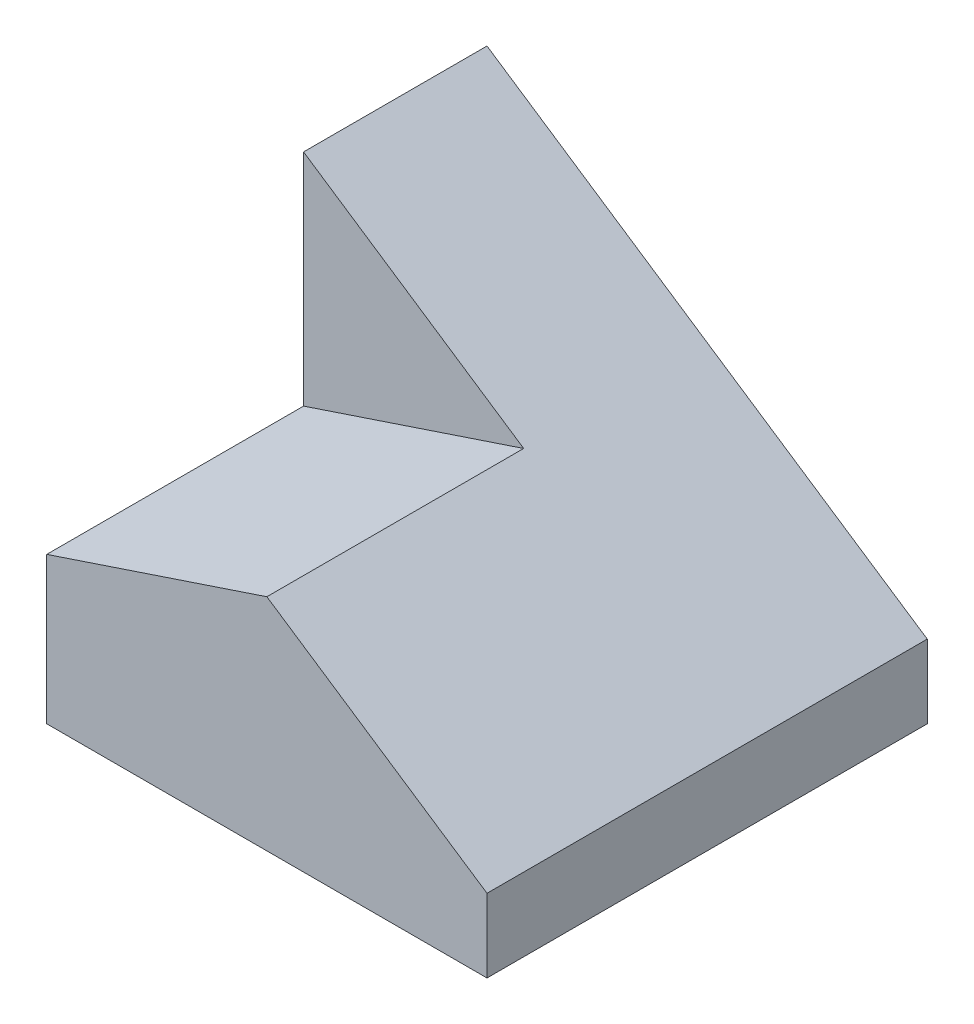
ISO-10303-21;
HEADER;
FILE_DESCRIPTION(('STEP AP214'),'2;1');
FILE_NAME('part.step','',(''),(''),'','','');
FILE_SCHEMA(('AUTOMOTIVE_DESIGN { 1 0 10303 214 1 1 1 1 }'));
ENDSEC;
DATA;
#1=APPLICATION_CONTEXT('core data for automotive mechanical design processes');
#2=APPLICATION_PROTOCOL_DEFINITION('international standard','automotive_design',2000,#1);
#3=PRODUCT_CONTEXT('',#1,'mechanical');
#4=PRODUCT('Part','Part','',(#3));
#5=PRODUCT_RELATED_PRODUCT_CATEGORY('part','',(#4));
#6=PRODUCT_DEFINITION_FORMATION('','',#4);
#7=PRODUCT_DEFINITION_CONTEXT('part definition',#1,'design');
#8=PRODUCT_DEFINITION('design','',#6,#7);
#9=PRODUCT_DEFINITION_SHAPE('','',#8);
#10=(LENGTH_UNIT() NAMED_UNIT(*) SI_UNIT(.MILLI.,.METRE.));
#11=(NAMED_UNIT(*) PLANE_ANGLE_UNIT() SI_UNIT($,.RADIAN.));
#12=(NAMED_UNIT(*) SI_UNIT($,.STERADIAN.) SOLID_ANGLE_UNIT());
#13=UNCERTAINTY_MEASURE_WITH_UNIT(LENGTH_MEASURE(1.E-05),#10,'distance_accuracy_value','');
#14=(GEOMETRIC_REPRESENTATION_CONTEXT(3) GLOBAL_UNCERTAINTY_ASSIGNED_CONTEXT((#13)) GLOBAL_UNIT_ASSIGNED_CONTEXT((#10,
#11,#12)) REPRESENTATION_CONTEXT('',''));
#15=CARTESIAN_POINT('',(0.,0.,0.));
#16=DIRECTION('',(0.,0.,1.));
#17=DIRECTION('',(1.,0.,0.));
#18=AXIS2_PLACEMENT_3D('',#15,#16,#17);
#19=CARTESIAN_POINT('',(3.,5.,3.));
#20=DIRECTION('',(-1.,0.,0.));
#21=DIRECTION('',(0.,0.,1.));
#22=AXIS2_PLACEMENT_3D('',#19,#20,#21);
#23=PLANE('',#22);
#24=DIRECTION('',(0.,-1.,0.));
#25=VECTOR('',#24,1.);
#26=CARTESIAN_POINT('',(3.,5.,-3.));
#27=LINE('',#26,#25);
#28=CARTESIAN_POINT('',(3.,0.999999999999999,-3.));
#29=VERTEX_POINT('',#28);
#30=CARTESIAN_POINT('',(3.,0.,-3.));
#31=VERTEX_POINT('',#30);
#32=EDGE_CURVE('E11',#29,#31,#27,.T.);
#33=ORIENTED_EDGE('',*,*,#32,.F.);
#34=DIRECTION('',(0.,0.,1.));
#35=VECTOR('',#34,1.);
#36=CARTESIAN_POINT('',(3.,0.999999999999999,-5.));
#37=LINE('',#36,#35);
#38=CARTESIAN_POINT('',(3.,0.999999999999999,3.));
#39=VERTEX_POINT('',#38);
#40=EDGE_CURVE('E110',#29,#39,#37,.T.);
#41=ORIENTED_EDGE('',*,*,#40,.T.);
#42=DIRECTION('',(0.,-1.,0.));
#43=VECTOR('',#42,1.);
#44=CARTESIAN_POINT('',(3.,5.,3.));
#45=LINE('',#44,#43);
#46=CARTESIAN_POINT('',(3.,0.,3.));
#47=VERTEX_POINT('',#46);
#48=EDGE_CURVE('E87',#39,#47,#45,.T.);
#49=ORIENTED_EDGE('',*,*,#48,.T.);
#50=DIRECTION('',(0.,0.,-1.));
#51=VECTOR('',#50,1.);
#52=CARTESIAN_POINT('',(3.,0.,3.));
#53=LINE('',#52,#51);
#54=EDGE_CURVE('E100',#47,#31,#53,.T.);
#55=ORIENTED_EDGE('',*,*,#54,.T.);
#56=EDGE_LOOP('',(#33,#41,#49,#55));
#57=FACE_BOUND('',#56,.T.);
#58=ADVANCED_FACE('F33',(#57),#23,.F.);
#59=CARTESIAN_POINT('',(-3.,5.,-3.));
#60=DIRECTION('',(0.,0.,1.));
#61=DIRECTION('',(1.,0.,0.));
#62=AXIS2_PLACEMENT_3D('',#59,#60,#61);
#63=PLANE('',#62);
#64=DIRECTION('',(0.,-1.,0.));
#65=VECTOR('',#64,1.);
#66=CARTESIAN_POINT('',(-3.,5.,-3.));
#67=LINE('',#66,#65);
#68=CARTESIAN_POINT('',(-3.,5.,-3.));
#69=VERTEX_POINT('',#68);
#70=CARTESIAN_POINT('',(-3.,0.,-3.));
#71=VERTEX_POINT('',#70);
#72=EDGE_CURVE('E40',#69,#71,#67,.T.);
#73=ORIENTED_EDGE('',*,*,#72,.F.);
#74=DIRECTION('',(0.832050294337844,-0.554700196225229,0.));
#75=VECTOR('',#74,1.);
#76=CARTESIAN_POINT('',(-3.,5.,-3.));
#77=LINE('',#76,#75);
#78=EDGE_CURVE('E56',#69,#29,#77,.T.);
#79=ORIENTED_EDGE('',*,*,#78,.T.);
#80=ORIENTED_EDGE('',*,*,#32,.T.);
#81=DIRECTION('',(-1.,0.,0.));
#82=VECTOR('',#81,1.);
#83=CARTESIAN_POINT('',(-3.,0.,-3.));
#84=LINE('',#83,#82);
#85=EDGE_CURVE('E96',#31,#71,#84,.T.);
#86=ORIENTED_EDGE('',*,*,#85,.T.);
#87=EDGE_LOOP('',(#73,#79,#80,#86));
#88=FACE_BOUND('',#87,.T.);
#89=ADVANCED_FACE('F142',(#88),#63,.F.);
#90=CARTESIAN_POINT('',(-3.,5.,3.));
#91=DIRECTION('',(1.,0.,0.));
#92=DIRECTION('',(0.,0.,-1.));
#93=AXIS2_PLACEMENT_3D('',#90,#91,#92);
#94=PLANE('',#93);
#95=DIRECTION('',(0.,-1.,0.));
#96=VECTOR('',#95,1.);
#97=CARTESIAN_POINT('',(-3.,5.,3.));
#98=LINE('',#97,#96);
#99=CARTESIAN_POINT('',(-3.,2.,3.));
#100=VERTEX_POINT('',#99);
#101=CARTESIAN_POINT('',(-3.,0.,3.));
#102=VERTEX_POINT('',#101);
#103=EDGE_CURVE('E74',#100,#102,#98,.T.);
#104=ORIENTED_EDGE('',*,*,#103,.F.);
#105=DIRECTION('',(0.,0.,1.));
#106=VECTOR('',#105,1.);
#107=CARTESIAN_POINT('',(-3.,2.,-0.5));
#108=LINE('',#107,#106);
#109=CARTESIAN_POINT('',(-3.,2.,-0.5));
#110=VERTEX_POINT('',#109);
#111=EDGE_CURVE('E124',#110,#100,#108,.T.);
#112=ORIENTED_EDGE('',*,*,#111,.F.);
#113=DIRECTION('',(0.,-1.,0.));
#114=VECTOR('',#113,1.);
#115=CARTESIAN_POINT('',(-3.,0.,-0.5));
#116=LINE('',#115,#114);
#117=CARTESIAN_POINT('',(-3.,5.,-0.5));
#118=VERTEX_POINT('',#117);
#119=EDGE_CURVE('E128',#118,#110,#116,.T.);
#120=ORIENTED_EDGE('',*,*,#119,.F.);
#121=DIRECTION('',(0.,0.,1.));
#122=VECTOR('',#121,1.);
#123=CARTESIAN_POINT('',(-3.,5.,3.));
#124=LINE('',#123,#122);
#125=EDGE_CURVE('E101',#69,#118,#124,.T.);
#126=ORIENTED_EDGE('',*,*,#125,.F.);
#127=ORIENTED_EDGE('',*,*,#72,.T.);
#128=DIRECTION('',(0.,0.,1.));
#129=VECTOR('',#128,1.);
#130=CARTESIAN_POINT('',(-3.,0.,3.));
#131=LINE('',#130,#129);
#132=EDGE_CURVE('E91',#71,#102,#131,.T.);
#133=ORIENTED_EDGE('',*,*,#132,.T.);
#134=EDGE_LOOP('',(#104,#112,#120,#126,#127,#133));
#135=FACE_BOUND('',#134,.T.);
#136=ADVANCED_FACE('F92',(#135),#94,.F.);
#137=CARTESIAN_POINT('',(-3.,5.,3.));
#138=DIRECTION('',(0.,0.,-1.));
#139=DIRECTION('',(-1.,0.,0.));
#140=AXIS2_PLACEMENT_3D('',#137,#138,#139);
#141=PLANE('',#140);
#142=DIRECTION('',(0.832050294337844,-0.554700196225229,0.));
#143=VECTOR('',#142,1.);
#144=CARTESIAN_POINT('',(1.38461538461538,2.07692307692308,3.));
#145=LINE('',#144,#143);
#146=CARTESIAN_POINT('',(0.,3.,3.));
#147=VERTEX_POINT('',#146);
#148=EDGE_CURVE('E113',#147,#39,#145,.T.);
#149=ORIENTED_EDGE('',*,*,#148,.F.);
#150=DIRECTION('',(0.948683298050514,0.316227766016838,0.));
#151=VECTOR('',#150,1.);
#152=CARTESIAN_POINT('',(-0.900000000000001,2.7,3.));
#153=LINE('',#152,#151);
#154=EDGE_CURVE('E84',#100,#147,#153,.T.);
#155=ORIENTED_EDGE('',*,*,#154,.F.);
#156=ORIENTED_EDGE('',*,*,#103,.T.);
#157=DIRECTION('',(1.,0.,0.));
#158=VECTOR('',#157,1.);
#159=CARTESIAN_POINT('',(-3.,0.,3.));
#160=LINE('',#159,#158);
#161=EDGE_CURVE('E80',#102,#47,#160,.T.);
#162=ORIENTED_EDGE('',*,*,#161,.T.);
#163=ORIENTED_EDGE('',*,*,#48,.F.);
#164=EDGE_LOOP('',(#149,#155,#156,#162,#163));
#165=FACE_BOUND('',#164,.T.);
#166=ADVANCED_FACE('F77',(#165),#141,.F.);
#167=CARTESIAN_POINT('',(0.,0.,0.));
#168=DIRECTION('',(0.,-1.,0.));
#169=DIRECTION('',(0.,0.,-1.));
#170=AXIS2_PLACEMENT_3D('',#167,#168,#169);
#171=PLANE('',#170);
#172=ORIENTED_EDGE('',*,*,#54,.F.);
#173=ORIENTED_EDGE('',*,*,#161,.F.);
#174=ORIENTED_EDGE('',*,*,#132,.F.);
#175=ORIENTED_EDGE('',*,*,#85,.F.);
#176=EDGE_LOOP('',(#172,#173,#174,#175));
#177=FACE_BOUND('',#176,.T.);
#178=ADVANCED_FACE('F98',(#177),#171,.T.);
#179=CARTESIAN_POINT('',(1.38461538461538,2.07692307692308,-5.));
#180=DIRECTION('',(-0.554700196225229,-0.832050294337844,0.));
#181=DIRECTION('',(0.832050294337844,-0.554700196225229,0.));
#182=AXIS2_PLACEMENT_3D('',#179,#180,#181);
#183=PLANE('',#182);
#184=DIRECTION('',(-0.832050294337844,0.554700196225229,0.));
#185=VECTOR('',#184,1.);
#186=CARTESIAN_POINT('',(1.38461538461538,2.07692307692308,-0.5));
#187=LINE('',#186,#185);
#188=CARTESIAN_POINT('',(0.,3.,-0.5));
#189=VERTEX_POINT('',#188);
#190=EDGE_CURVE('E127',#189,#118,#187,.T.);
#191=ORIENTED_EDGE('',*,*,#190,.F.);
#192=DIRECTION('',(0.,0.,1.));
#193=VECTOR('',#192,1.);
#194=CARTESIAN_POINT('',(0.,3.,-0.5));
#195=LINE('',#194,#193);
#196=EDGE_CURVE('E125',#189,#147,#195,.T.);
#197=ORIENTED_EDGE('',*,*,#196,.T.);
#198=ORIENTED_EDGE('',*,*,#148,.T.);
#199=ORIENTED_EDGE('',*,*,#40,.F.);
#200=ORIENTED_EDGE('',*,*,#78,.F.);
#201=ORIENTED_EDGE('',*,*,#125,.T.);
#202=EDGE_LOOP('',(#191,#197,#198,#199,#200,#201));
#203=FACE_BOUND('',#202,.T.);
#204=ADVANCED_FACE('F143',(#203),#183,.F.);
#205=CARTESIAN_POINT('',(-0.900000000000001,2.7,-0.5));
#206=DIRECTION('',(0.316227766016838,-0.948683298050514,0.));
#207=DIRECTION('',(0.948683298050514,0.316227766016838,0.));
#208=AXIS2_PLACEMENT_3D('',#205,#206,#207);
#209=PLANE('',#208);
#210=ORIENTED_EDGE('',*,*,#154,.T.);
#211=ORIENTED_EDGE('',*,*,#196,.F.);
#212=DIRECTION('',(0.948683298050514,0.316227766016838,0.));
#213=VECTOR('',#212,1.);
#214=CARTESIAN_POINT('',(-0.900000000000001,2.7,-0.5));
#215=LINE('',#214,#213);
#216=EDGE_CURVE('E47',#110,#189,#215,.T.);
#217=ORIENTED_EDGE('',*,*,#216,.F.);
#218=ORIENTED_EDGE('',*,*,#111,.T.);
#219=EDGE_LOOP('',(#210,#211,#217,#218));
#220=FACE_BOUND('',#219,.T.);
#221=ADVANCED_FACE('F123',(#220),#209,.F.);
#222=CARTESIAN_POINT('',(0.,0.,-0.5));
#223=DIRECTION('',(0.,0.,1.));
#224=DIRECTION('',(1.,0.,0.));
#225=AXIS2_PLACEMENT_3D('',#222,#223,#224);
#226=PLANE('',#225);
#227=ORIENTED_EDGE('',*,*,#119,.T.);
#228=ORIENTED_EDGE('',*,*,#216,.T.);
#229=ORIENTED_EDGE('',*,*,#190,.T.);
#230=EDGE_LOOP('',(#227,#228,#229));
#231=FACE_BOUND('',#230,.T.);
#232=ADVANCED_FACE('F131',(#231),#226,.T.);
#233=CLOSED_SHELL('',(#58,#89,#136,#166,#178,#204,#221,#232));
#234=MANIFOLD_SOLID_BREP('B2',#233);
#235=ADVANCED_BREP_SHAPE_REPRESENTATION('',(#18,#234),#14);
#236=SHAPE_DEFINITION_REPRESENTATION(#9,#235);
ENDSEC;
END-ISO-10303-21;
